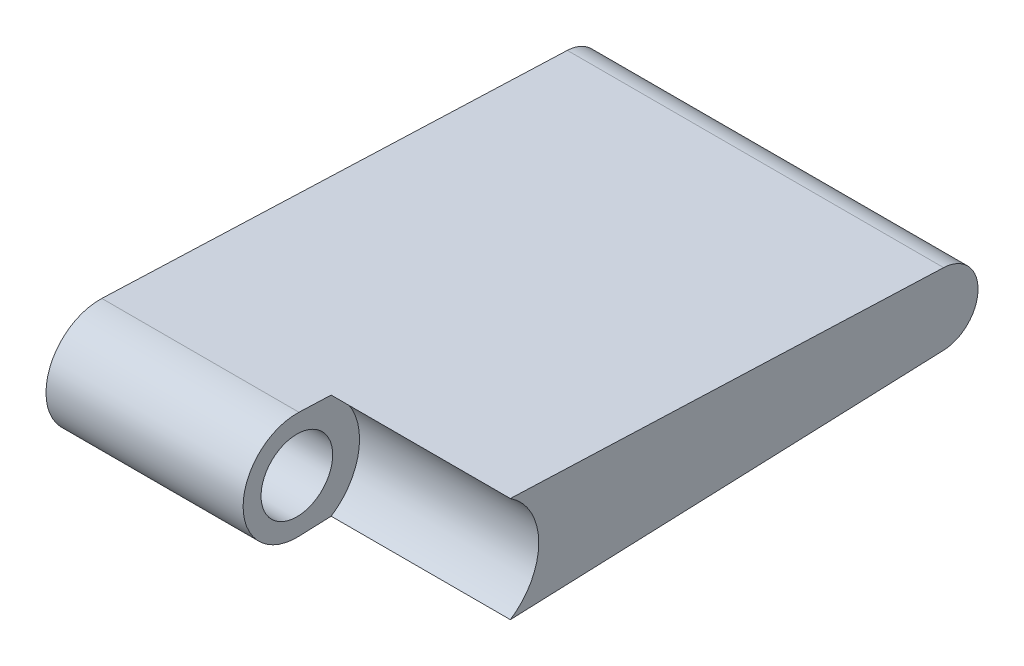
ISO-10303-21;
HEADER;
FILE_DESCRIPTION(('STEP AP214'),'2;1');
FILE_NAME('part.step','',(''),(''),'','','');
FILE_SCHEMA(('AUTOMOTIVE_DESIGN { 1 0 10303 214 1 1 1 1 }'));
ENDSEC;
DATA;
#1=APPLICATION_CONTEXT('core data for automotive mechanical design processes');
#2=APPLICATION_PROTOCOL_DEFINITION('international standard','automotive_design',2000,#1);
#3=PRODUCT_CONTEXT('',#1,'mechanical');
#4=PRODUCT('Part','Part','',(#3));
#5=PRODUCT_RELATED_PRODUCT_CATEGORY('part','',(#4));
#6=PRODUCT_DEFINITION_FORMATION('','',#4);
#7=PRODUCT_DEFINITION_CONTEXT('part definition',#1,'design');
#8=PRODUCT_DEFINITION('design','',#6,#7);
#9=PRODUCT_DEFINITION_SHAPE('','',#8);
#10=(LENGTH_UNIT() NAMED_UNIT(*) SI_UNIT(.MILLI.,.METRE.));
#11=(NAMED_UNIT(*) PLANE_ANGLE_UNIT() SI_UNIT($,.RADIAN.));
#12=(NAMED_UNIT(*) SI_UNIT($,.STERADIAN.) SOLID_ANGLE_UNIT());
#13=UNCERTAINTY_MEASURE_WITH_UNIT(LENGTH_MEASURE(1.E-05),#10,'distance_accuracy_value','');
#14=(GEOMETRIC_REPRESENTATION_CONTEXT(3) GLOBAL_UNCERTAINTY_ASSIGNED_CONTEXT((#13)) GLOBAL_UNIT_ASSIGNED_CONTEXT((#10,
#11,#12)) REPRESENTATION_CONTEXT('',''));
#15=CARTESIAN_POINT('',(0.,0.,0.));
#16=DIRECTION('',(0.,0.,1.));
#17=DIRECTION('',(1.,0.,0.));
#18=AXIS2_PLACEMENT_3D('',#15,#16,#17);
#19=CARTESIAN_POINT('',(-16.46682,0.,10.2266422824923));
#20=DIRECTION('',(1.,0.,0.));
#21=DIRECTION('',(0.,0.,-1.));
#22=AXIS2_PLACEMENT_3D('',#19,#20,#21);
#23=CYLINDRICAL_SURFACE('',#22,2.35204);
#24=DIRECTION('',(1.,0.,0.));
#25=VECTOR('',#24,1.);
#26=CARTESIAN_POINT('',(-16.46682,-2.3502988144753,10.1361566799027));
#27=LINE('',#26,#25);
#28=CARTESIAN_POINT('',(-16.46682,-2.3502988144753,10.1361566799027));
#29=VERTEX_POINT('',#28);
#30=CARTESIAN_POINT('',(-7.84098,-2.3502988144753,10.1361566799027));
#31=VERTEX_POINT('',#30);
#32=EDGE_CURVE('E78',#29,#31,#27,.T.);
#33=ORIENTED_EDGE('',*,*,#32,.T.);
#34=CARTESIAN_POINT('',(-7.84098,0.,10.2266422824923));
#35=DIRECTION('',(1.,0.,0.));
#36=DIRECTION('',(0.,0.,-1.));
#37=AXIS2_PLACEMENT_3D('',#34,#35,#36);
#38=CIRCLE('',#37,2.35204);
#39=CARTESIAN_POINT('',(-7.84098,2.3502988144753,10.1361566799027));
#40=VERTEX_POINT('',#39);
#41=EDGE_CURVE('E103',#31,#40,#38,.F.);
#42=ORIENTED_EDGE('',*,*,#41,.T.);
#43=DIRECTION('',(1.,0.,0.));
#44=VECTOR('',#43,1.);
#45=CARTESIAN_POINT('',(-16.46682,2.3502988144753,10.1361566799027));
#46=LINE('',#45,#44);
#47=CARTESIAN_POINT('',(-16.46682,2.3502988144753,10.1361566799027));
#48=VERTEX_POINT('',#47);
#49=EDGE_CURVE('E55',#48,#40,#46,.T.);
#50=ORIENTED_EDGE('',*,*,#49,.F.);
#51=CARTESIAN_POINT('',(-16.46682,0.,10.2266422824923));
#52=DIRECTION('',(1.,0.,0.));
#53=DIRECTION('',(0.,0.,-1.));
#54=AXIS2_PLACEMENT_3D('',#51,#52,#53);
#55=CIRCLE('',#54,2.35204);
#56=EDGE_CURVE('E118',#48,#29,#55,.T.);
#57=ORIENTED_EDGE('',*,*,#56,.T.);
#58=EDGE_LOOP('',(#33,#42,#50,#57));
#59=FACE_BOUND('',#58,.T.);
#60=ADVANCED_FACE('F32',(#59),#23,.T.);
#61=CARTESIAN_POINT('',(-16.46682,2.3502988144753,10.1361566799027));
#62=DIRECTION('',(0.,0.999259712621936,-0.0384711155378486));
#63=DIRECTION('',(0.,0.0384711155378486,0.999259712621936));
#64=AXIS2_PLACEMENT_3D('',#61,#62,#63);
#65=PLANE('',#64);
#66=DIRECTION('',(1.,0.,0.));
#67=VECTOR('',#66,1.);
#68=CARTESIAN_POINT('',(-7.84098,2.29598699889328,8.72544611246224));
#69=LINE('',#68,#67);
#70=CARTESIAN_POINT('',(0.,2.29598699889328,8.72544611246224));
#71=VERTEX_POINT('',#70);
#72=CARTESIAN_POINT('',(-7.84098,2.29598699889328,8.72544611246224));
#73=VERTEX_POINT('',#72);
#74=EDGE_CURVE('E95',#71,#73,#69,.F.);
#75=ORIENTED_EDGE('',*,*,#74,.F.);
#76=DIRECTION('',(0.,0.0384711155378486,0.999259712621936));
#77=VECTOR('',#76,1.);
#78=CARTESIAN_POINT('',(0.,2.3502988144753,10.1361566799027));
#79=LINE('',#78,#77);
#80=CARTESIAN_POINT('',(0.,1.56601983642685,-10.2349288803563));
#81=VERTEX_POINT('',#80);
#82=EDGE_CURVE('E121',#81,#71,#79,.T.);
#83=ORIENTED_EDGE('',*,*,#82,.F.);
#84=DIRECTION('',(1.,0.,0.));
#85=VECTOR('',#84,1.);
#86=CARTESIAN_POINT('',(-16.46682,1.56601983642685,-10.2349288803563));
#87=LINE('',#86,#85);
#88=CARTESIAN_POINT('',(-16.46682,1.56601983642685,-10.2349288803563));
#89=VERTEX_POINT('',#88);
#90=EDGE_CURVE('E71',#89,#81,#87,.T.);
#91=ORIENTED_EDGE('',*,*,#90,.F.);
#92=DIRECTION('',(0.,0.0384711155378486,0.999259712621936));
#93=VECTOR('',#92,1.);
#94=CARTESIAN_POINT('',(-16.46682,2.3502988144753,10.1361566799027));
#95=LINE('',#94,#93);
#96=EDGE_CURVE('E125',#89,#48,#95,.T.);
#97=ORIENTED_EDGE('',*,*,#96,.T.);
#98=ORIENTED_EDGE('',*,*,#49,.T.);
#99=DIRECTION('',(0.,-0.0384711155378486,-0.999259712621936));
#100=VECTOR('',#99,1.);
#101=CARTESIAN_POINT('',(-7.84098,2.3502988144753,10.1361566799027));
#102=LINE('',#101,#100);
#103=EDGE_CURVE('E107',#40,#73,#102,.T.);
#104=ORIENTED_EDGE('',*,*,#103,.T.);
#105=EDGE_LOOP('',(#75,#83,#91,#97,#98,#104));
#106=FACE_BOUND('',#105,.T.);
#107=ADVANCED_FACE('F110',(#106),#65,.T.);
#108=CARTESIAN_POINT('',(-16.46682,0.,-10.1746377175077));
#109=DIRECTION('',(1.,0.,0.));
#110=DIRECTION('',(0.,0.,-1.));
#111=AXIS2_PLACEMENT_3D('',#108,#109,#110);
#112=CYLINDRICAL_SURFACE('',#111,1.56718);
#113=CARTESIAN_POINT('',(0.,0.,-10.1746377175077));
#114=DIRECTION('',(1.,0.,0.));
#115=DIRECTION('',(0.,0.,-1.));
#116=AXIS2_PLACEMENT_3D('',#113,#114,#115);
#117=CIRCLE('',#116,1.56718);
#118=CARTESIAN_POINT('',(0.,-1.56601983642685,-10.2349288803563));
#119=VERTEX_POINT('',#118);
#120=EDGE_CURVE('E114',#119,#81,#117,.T.);
#121=ORIENTED_EDGE('',*,*,#120,.F.);
#122=DIRECTION('',(1.,0.,0.));
#123=VECTOR('',#122,1.);
#124=CARTESIAN_POINT('',(-16.46682,-1.56601983642685,-10.2349288803563));
#125=LINE('',#124,#123);
#126=CARTESIAN_POINT('',(-16.46682,-1.56601983642685,-10.2349288803563));
#127=VERTEX_POINT('',#126);
#128=EDGE_CURVE('E131',#127,#119,#125,.T.);
#129=ORIENTED_EDGE('',*,*,#128,.F.);
#130=CARTESIAN_POINT('',(-16.46682,0.,-10.1746377175077));
#131=DIRECTION('',(1.,0.,0.));
#132=DIRECTION('',(0.,0.,-1.));
#133=AXIS2_PLACEMENT_3D('',#130,#131,#132);
#134=CIRCLE('',#133,1.56718);
#135=EDGE_CURVE('E123',#127,#89,#134,.T.);
#136=ORIENTED_EDGE('',*,*,#135,.T.);
#137=ORIENTED_EDGE('',*,*,#90,.T.);
#138=EDGE_LOOP('',(#121,#129,#136,#137));
#139=FACE_BOUND('',#138,.T.);
#140=ADVANCED_FACE('F138',(#139),#112,.T.);
#141=CARTESIAN_POINT('',(-16.46682,-2.3502988144753,10.1361566799027));
#142=DIRECTION('',(0.,-0.999259712621936,-0.0384711155378485));
#143=DIRECTION('',(0.,0.0384711155378485,-0.999259712621936));
#144=AXIS2_PLACEMENT_3D('',#141,#142,#143);
#145=PLANE('',#144);
#146=DIRECTION('',(1.,0.,0.));
#147=VECTOR('',#146,1.);
#148=CARTESIAN_POINT('',(-7.84098,-2.29598699889328,8.72544611246224));
#149=LINE('',#148,#147);
#150=CARTESIAN_POINT('',(-7.84098,-2.29598699889328,8.72544611246224));
#151=VERTEX_POINT('',#150);
#152=CARTESIAN_POINT('',(0.,-2.29598699889328,8.72544611246224));
#153=VERTEX_POINT('',#152);
#154=EDGE_CURVE('E46',#151,#153,#149,.T.);
#155=ORIENTED_EDGE('',*,*,#154,.F.);
#156=DIRECTION('',(0.,-0.0384711155378485,0.999259712621936));
#157=VECTOR('',#156,1.);
#158=CARTESIAN_POINT('',(-7.84098,-2.3502988144753,10.1361566799027));
#159=LINE('',#158,#157);
#160=EDGE_CURVE('E11',#151,#31,#159,.T.);
#161=ORIENTED_EDGE('',*,*,#160,.T.);
#162=ORIENTED_EDGE('',*,*,#32,.F.);
#163=DIRECTION('',(0.,0.0384711155378485,-0.999259712621936));
#164=VECTOR('',#163,1.);
#165=CARTESIAN_POINT('',(-16.46682,-2.3502988144753,10.1361566799027));
#166=LINE('',#165,#164);
#167=EDGE_CURVE('E120',#29,#127,#166,.T.);
#168=ORIENTED_EDGE('',*,*,#167,.T.);
#169=ORIENTED_EDGE('',*,*,#128,.T.);
#170=DIRECTION('',(0.,0.0384711155378485,-0.999259712621936));
#171=VECTOR('',#170,1.);
#172=CARTESIAN_POINT('',(0.,-2.3502988144753,10.1361566799027));
#173=LINE('',#172,#171);
#174=EDGE_CURVE('E112',#153,#119,#173,.T.);
#175=ORIENTED_EDGE('',*,*,#174,.F.);
#176=EDGE_LOOP('',(#155,#161,#162,#168,#169,#175));
#177=FACE_BOUND('',#176,.T.);
#178=ADVANCED_FACE('F139',(#177),#145,.T.);
#179=CARTESIAN_POINT('',(-16.46682,0.,10.2266422824923));
#180=DIRECTION('',(1.,0.,0.));
#181=DIRECTION('',(0.,0.,-1.));
#182=AXIS2_PLACEMENT_3D('',#179,#180,#181);
#183=PLANE('',#182);
#184=CARTESIAN_POINT('',(-16.46682,0.,10.2266422824923));
#185=DIRECTION('',(1.,0.,0.));
#186=DIRECTION('',(0.,0.,-1.));
#187=AXIS2_PLACEMENT_3D('',#184,#185,#186);
#188=CIRCLE('',#187,1.56718);
#189=CARTESIAN_POINT('',(-16.46682,0.,8.65946228249234));
#190=VERTEX_POINT('',#189);
#191=EDGE_CURVE('E108',#190,#190,#188,.T.);
#192=ORIENTED_EDGE('',*,*,#191,.T.);
#193=EDGE_LOOP('',(#192));
#194=FACE_BOUND('',#193,.T.);
#195=ORIENTED_EDGE('',*,*,#56,.F.);
#196=ORIENTED_EDGE('',*,*,#96,.F.);
#197=ORIENTED_EDGE('',*,*,#135,.F.);
#198=ORIENTED_EDGE('',*,*,#167,.F.);
#199=EDGE_LOOP('',(#195,#196,#197,#198));
#200=FACE_BOUND('',#199,.T.);
#201=ADVANCED_FACE('F136',(#194,#200),#183,.F.);
#202=CARTESIAN_POINT('',(0.,0.,10.2266422824923));
#203=DIRECTION('',(1.,0.,0.));
#204=DIRECTION('',(0.,0.,-1.));
#205=AXIS2_PLACEMENT_3D('',#202,#203,#204);
#206=PLANE('',#205);
#207=CARTESIAN_POINT('',(0.,0.,10.2266422824923));
#208=DIRECTION('',(1.,0.,0.));
#209=DIRECTION('',(0.,0.,-1.));
#210=AXIS2_PLACEMENT_3D('',#207,#208,#209);
#211=CIRCLE('',#210,2.7432);
#212=EDGE_CURVE('E39',#153,#71,#211,.T.);
#213=ORIENTED_EDGE('',*,*,#212,.F.);
#214=ORIENTED_EDGE('',*,*,#174,.T.);
#215=ORIENTED_EDGE('',*,*,#120,.T.);
#216=ORIENTED_EDGE('',*,*,#82,.T.);
#217=EDGE_LOOP('',(#213,#214,#215,#216));
#218=FACE_BOUND('',#217,.T.);
#219=ADVANCED_FACE('F142',(#218),#206,.T.);
#220=CARTESIAN_POINT('',(-7.84098,0.,10.2266422824923));
#221=DIRECTION('',(1.,0.,0.));
#222=DIRECTION('',(0.,0.,-1.));
#223=AXIS2_PLACEMENT_3D('',#220,#221,#222);
#224=CYLINDRICAL_SURFACE('',#223,2.7432);
#225=ORIENTED_EDGE('',*,*,#74,.T.);
#226=CARTESIAN_POINT('',(-7.84098,0.,10.2266422824923));
#227=DIRECTION('',(1.,0.,0.));
#228=DIRECTION('',(0.,0.,-1.));
#229=AXIS2_PLACEMENT_3D('',#226,#227,#228);
#230=CIRCLE('',#229,2.7432);
#231=EDGE_CURVE('E98',#151,#73,#230,.T.);
#232=ORIENTED_EDGE('',*,*,#231,.F.);
#233=ORIENTED_EDGE('',*,*,#154,.T.);
#234=ORIENTED_EDGE('',*,*,#212,.T.);
#235=EDGE_LOOP('',(#225,#232,#233,#234));
#236=FACE_BOUND('',#235,.T.);
#237=ADVANCED_FACE('F97',(#236),#224,.F.);
#238=CARTESIAN_POINT('',(-7.84098,0.,10.2266422824923));
#239=DIRECTION('',(1.,0.,0.));
#240=DIRECTION('',(0.,0.,-1.));
#241=AXIS2_PLACEMENT_3D('',#238,#239,#240);
#242=PLANE('',#241);
#243=CARTESIAN_POINT('',(-7.84098,0.,10.2266422824923));
#244=DIRECTION('',(1.,0.,0.));
#245=DIRECTION('',(0.,0.,-1.));
#246=AXIS2_PLACEMENT_3D('',#243,#244,#245);
#247=CIRCLE('',#246,1.56718);
#248=CARTESIAN_POINT('',(-7.84098,0.,8.65946228249234));
#249=VERTEX_POINT('',#248);
#250=EDGE_CURVE('E202',#249,#249,#247,.T.);
#251=ORIENTED_EDGE('',*,*,#250,.F.);
#252=EDGE_LOOP('',(#251));
#253=FACE_BOUND('',#252,.T.);
#254=ORIENTED_EDGE('',*,*,#41,.F.);
#255=ORIENTED_EDGE('',*,*,#160,.F.);
#256=ORIENTED_EDGE('',*,*,#231,.T.);
#257=ORIENTED_EDGE('',*,*,#103,.F.);
#258=EDGE_LOOP('',(#254,#255,#256,#257));
#259=FACE_BOUND('',#258,.T.);
#260=ADVANCED_FACE('F106',(#253,#259),#242,.T.);
#261=CARTESIAN_POINT('',(-16.46682,0.,10.2266422824923));
#262=DIRECTION('',(1.,0.,0.));
#263=DIRECTION('',(0.,0.,-1.));
#264=AXIS2_PLACEMENT_3D('',#261,#262,#263);
#265=CYLINDRICAL_SURFACE('',#264,1.56718);
#266=ORIENTED_EDGE('',*,*,#191,.F.);
#267=EDGE_LOOP('',(#266));
#268=FACE_BOUND('',#267,.T.);
#269=ORIENTED_EDGE('',*,*,#250,.T.);
#270=EDGE_LOOP('',(#269));
#271=FACE_BOUND('',#270,.T.);
#272=ADVANCED_FACE('F183',(#268,#271),#265,.F.);
#273=CLOSED_SHELL('',(#60,#107,#140,#178,#201,#219,#237,#260,#272));
#274=MANIFOLD_SOLID_BREP('B2',#273);
#275=ADVANCED_BREP_SHAPE_REPRESENTATION('',(#18,#274),#14);
#276=SHAPE_DEFINITION_REPRESENTATION(#9,#275);
ENDSEC;
END-ISO-10303-21;
